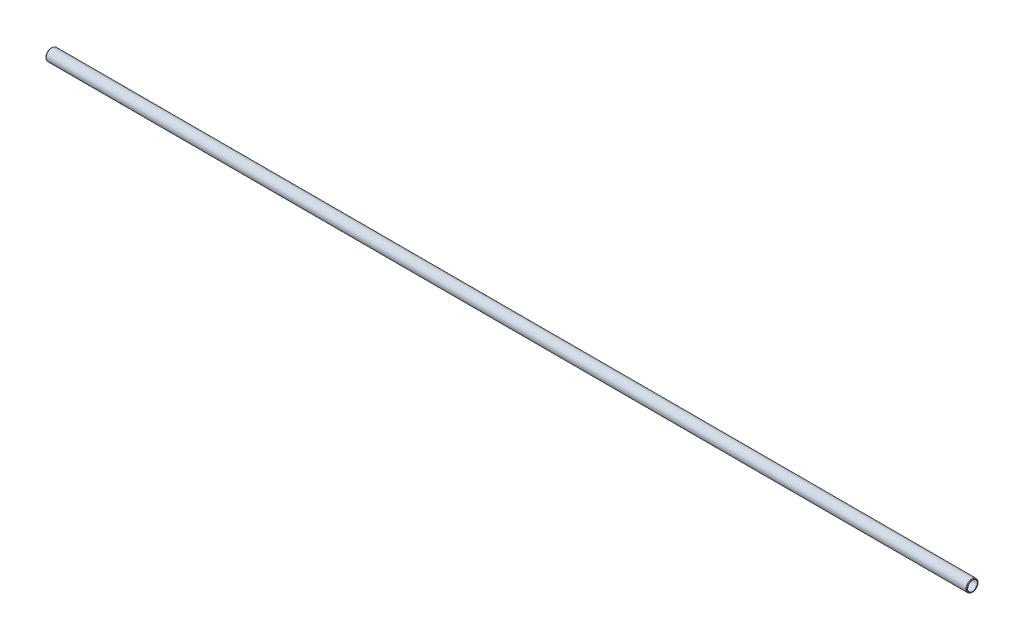
ISO-10303-21;
HEADER;
FILE_DESCRIPTION(('STEP AP214'),'2;1');
FILE_NAME('part.step','',(''),(''),'','','');
FILE_SCHEMA(('AUTOMOTIVE_DESIGN { 1 0 10303 214 1 1 1 1 }'));
ENDSEC;
DATA;
#1=APPLICATION_CONTEXT('core data for automotive mechanical design processes');
#2=APPLICATION_PROTOCOL_DEFINITION('international standard','automotive_design',2000,#1);
#3=PRODUCT_CONTEXT('',#1,'mechanical');
#4=PRODUCT('Part','Part','',(#3));
#5=PRODUCT_RELATED_PRODUCT_CATEGORY('part','',(#4));
#6=PRODUCT_DEFINITION_FORMATION('','',#4);
#7=PRODUCT_DEFINITION_CONTEXT('part definition',#1,'design');
#8=PRODUCT_DEFINITION('design','',#6,#7);
#9=PRODUCT_DEFINITION_SHAPE('','',#8);
#10=(LENGTH_UNIT() NAMED_UNIT(*) SI_UNIT(.MILLI.,.METRE.));
#11=(NAMED_UNIT(*) PLANE_ANGLE_UNIT() SI_UNIT($,.RADIAN.));
#12=(NAMED_UNIT(*) SI_UNIT($,.STERADIAN.) SOLID_ANGLE_UNIT());
#13=UNCERTAINTY_MEASURE_WITH_UNIT(LENGTH_MEASURE(1.E-05),#10,'distance_accuracy_value','');
#14=(GEOMETRIC_REPRESENTATION_CONTEXT(3) GLOBAL_UNCERTAINTY_ASSIGNED_CONTEXT((#13)) GLOBAL_UNIT_ASSIGNED_CONTEXT((#10,
#11,#12)) REPRESENTATION_CONTEXT('',''));
#15=CARTESIAN_POINT('',(0.,0.,0.));
#16=DIRECTION('',(0.,0.,1.));
#17=DIRECTION('',(1.,0.,0.));
#18=AXIS2_PLACEMENT_3D('',#15,#16,#17);
#19=CARTESIAN_POINT('',(-0.306605122421363,0.,0.));
#20=DIRECTION('',(-1.,0.,0.));
#21=DIRECTION('',(0.,0.,1.));
#22=AXIS2_PLACEMENT_3D('',#19,#20,#21);
#23=TOROIDAL_SURFACE('',#22,5.3947602448428,0.127000000000017);
#24=CARTESIAN_POINT('',(-0.396407683632027,0.,0.));
#25=DIRECTION('',(-1.,0.,0.));
#26=DIRECTION('',(0.,0.,1.));
#27=AXIS2_PLACEMENT_3D('',#24,#25,#26);
#28=CIRCLE('',#27,5.3049576836321);
#29=CARTESIAN_POINT('',(-0.396407683632027,0.,5.3049576836321));
#30=VERTEX_POINT('',#29);
#31=EDGE_CURVE('E10',#30,#30,#28,.T.);
#32=ORIENTED_EDGE('',*,*,#31,.F.);
#33=EDGE_LOOP('',(#32));
#34=FACE_BOUND('',#33,.T.);
#35=CARTESIAN_POINT('',(-0.396407683632027,0.,0.));
#36=DIRECTION('',(-1.,0.,0.));
#37=DIRECTION('',(0.,0.,1.));
#38=AXIS2_PLACEMENT_3D('',#35,#36,#37);
#39=CIRCLE('',#38,5.4845628060535);
#40=CARTESIAN_POINT('',(-0.396407683632027,0.,5.4845628060535));
#41=VERTEX_POINT('',#40);
#42=EDGE_CURVE('E78',#41,#41,#39,.T.);
#43=ORIENTED_EDGE('',*,*,#42,.T.);
#44=EDGE_LOOP('',(#43));
#45=FACE_BOUND('',#44,.T.);
#46=ADVANCED_FACE('F32',(#34,#45),#23,.T.);
#47=CARTESIAN_POINT('',(-0.396407683632027,0.,0.));
#48=DIRECTION('',(-1.,0.,0.));
#49=DIRECTION('',(0.,0.,1.));
#50=AXIS2_PLACEMENT_3D('',#47,#48,#49);
#51=CONICAL_SURFACE('',#50,5.3049576836321,0.785398163397622);
#52=CARTESIAN_POINT('',(-0.253999999999976,0.,0.));
#53=DIRECTION('',(-1.,0.,0.));
#54=DIRECTION('',(0.,0.,1.));
#55=AXIS2_PLACEMENT_3D('',#52,#53,#54);
#56=CIRCLE('',#55,5.16255);
#57=CARTESIAN_POINT('',(-0.253999999999976,0.,5.16255));
#58=VERTEX_POINT('',#57);
#59=EDGE_CURVE('E38',#58,#58,#56,.T.);
#60=ORIENTED_EDGE('',*,*,#59,.F.);
#61=EDGE_LOOP('',(#60));
#62=FACE_BOUND('',#61,.T.);
#63=ORIENTED_EDGE('',*,*,#31,.T.);
#64=EDGE_LOOP('',(#63));
#65=FACE_BOUND('',#64,.T.);
#66=ADVANCED_FACE('F151',(#62,#65),#51,.F.);
#67=CARTESIAN_POINT('',(959.358,0.,0.));
#68=DIRECTION('',(-1.,0.,0.));
#69=DIRECTION('',(0.,0.,1.));
#70=AXIS2_PLACEMENT_3D('',#67,#68,#69);
#71=CYLINDRICAL_SURFACE('',#70,5.16255);
#72=CARTESIAN_POINT('',(0.,0.,0.));
#73=DIRECTION('',(-1.,0.,0.));
#74=DIRECTION('',(0.,0.,1.));
#75=AXIS2_PLACEMENT_3D('',#72,#73,#74);
#76=CIRCLE('',#75,5.16255);
#77=CARTESIAN_POINT('',(0.,0.,5.16255));
#78=VERTEX_POINT('',#77);
#79=EDGE_CURVE('E42',#78,#78,#76,.T.);
#80=ORIENTED_EDGE('',*,*,#79,.F.);
#81=EDGE_LOOP('',(#80));
#82=FACE_BOUND('',#81,.T.);
#83=ORIENTED_EDGE('',*,*,#59,.T.);
#84=EDGE_LOOP('',(#83));
#85=FACE_BOUND('',#84,.T.);
#86=ADVANCED_FACE('F146',(#82,#85),#71,.F.);
#87=CARTESIAN_POINT('',(0.,0.,0.));
#88=DIRECTION('',(1.,0.,0.));
#89=DIRECTION('',(0.,0.,-1.));
#90=AXIS2_PLACEMENT_3D('',#87,#88,#89);
#91=CONICAL_SURFACE('',#90,5.16255,0.785398163397495);
#92=CARTESIAN_POINT('',(0.507999999999953,0.,0.));
#93=DIRECTION('',(-1.,0.,0.));
#94=DIRECTION('',(0.,0.,1.));
#95=AXIS2_PLACEMENT_3D('',#92,#93,#94);
#96=CIRCLE('',#95,5.67055);
#97=CARTESIAN_POINT('',(0.507999999999953,0.,5.67055));
#98=VERTEX_POINT('',#97);
#99=EDGE_CURVE('E46',#98,#98,#96,.T.);
#100=ORIENTED_EDGE('',*,*,#99,.F.);
#101=EDGE_LOOP('',(#100));
#102=FACE_BOUND('',#101,.T.);
#103=ORIENTED_EDGE('',*,*,#79,.T.);
#104=EDGE_LOOP('',(#103));
#105=FACE_BOUND('',#104,.T.);
#106=ADVANCED_FACE('F140',(#102,#105),#91,.F.);
#107=CARTESIAN_POINT('',(959.358,0.,0.));
#108=DIRECTION('',(-1.,0.,0.));
#109=DIRECTION('',(0.,0.,1.));
#110=AXIS2_PLACEMENT_3D('',#107,#108,#109);
#111=CYLINDRICAL_SURFACE('',#110,5.67055);
#112=CARTESIAN_POINT('',(958.85,0.,0.));
#113=DIRECTION('',(-1.,0.,0.));
#114=DIRECTION('',(0.,0.,1.));
#115=AXIS2_PLACEMENT_3D('',#112,#113,#114);
#116=CIRCLE('',#115,5.67055);
#117=CARTESIAN_POINT('',(958.85,0.,5.67055));
#118=VERTEX_POINT('',#117);
#119=EDGE_CURVE('E51',#118,#118,#116,.T.);
#120=ORIENTED_EDGE('',*,*,#119,.F.);
#121=EDGE_LOOP('',(#120));
#122=FACE_BOUND('',#121,.T.);
#123=ORIENTED_EDGE('',*,*,#99,.T.);
#124=EDGE_LOOP('',(#123));
#125=FACE_BOUND('',#124,.T.);
#126=ADVANCED_FACE('F134',(#122,#125),#111,.F.);
#127=CARTESIAN_POINT('',(958.85,0.,0.));
#128=DIRECTION('',(-1.,0.,0.));
#129=DIRECTION('',(0.,0.,1.));
#130=AXIS2_PLACEMENT_3D('',#127,#128,#129);
#131=CONICAL_SURFACE('',#130,5.67055,0.785398163397604);
#132=CARTESIAN_POINT('',(959.358,0.,0.));
#133=DIRECTION('',(-1.,0.,0.));
#134=DIRECTION('',(0.,0.,1.));
#135=AXIS2_PLACEMENT_3D('',#132,#133,#134);
#136=CIRCLE('',#135,5.16255);
#137=CARTESIAN_POINT('',(959.358,0.,5.16255));
#138=VERTEX_POINT('',#137);
#139=EDGE_CURVE('E54',#138,#138,#136,.T.);
#140=ORIENTED_EDGE('',*,*,#139,.F.);
#141=EDGE_LOOP('',(#140));
#142=FACE_BOUND('',#141,.T.);
#143=ORIENTED_EDGE('',*,*,#119,.T.);
#144=EDGE_LOOP('',(#143));
#145=FACE_BOUND('',#144,.T.);
#146=ADVANCED_FACE('F128',(#142,#145),#131,.F.);
#147=CARTESIAN_POINT('',(959.358,0.,0.));
#148=DIRECTION('',(-1.,0.,0.));
#149=DIRECTION('',(0.,0.,1.));
#150=AXIS2_PLACEMENT_3D('',#147,#148,#149);
#151=CYLINDRICAL_SURFACE('',#150,5.16255);
#152=CARTESIAN_POINT('',(959.612,0.,0.));
#153=DIRECTION('',(-1.,0.,0.));
#154=DIRECTION('',(0.,0.,1.));
#155=AXIS2_PLACEMENT_3D('',#152,#153,#154);
#156=CIRCLE('',#155,5.16255);
#157=CARTESIAN_POINT('',(959.612,0.,5.16255));
#158=VERTEX_POINT('',#157);
#159=EDGE_CURVE('E57',#158,#158,#156,.T.);
#160=ORIENTED_EDGE('',*,*,#159,.F.);
#161=EDGE_LOOP('',(#160));
#162=FACE_BOUND('',#161,.T.);
#163=ORIENTED_EDGE('',*,*,#139,.T.);
#164=EDGE_LOOP('',(#163));
#165=FACE_BOUND('',#164,.T.);
#166=ADVANCED_FACE('F122',(#162,#165),#151,.F.);
#167=CARTESIAN_POINT('',(959.612,0.,0.));
#168=DIRECTION('',(1.,0.,0.));
#169=DIRECTION('',(0.,0.,-1.));
#170=AXIS2_PLACEMENT_3D('',#167,#168,#169);
#171=CONICAL_SURFACE('',#170,5.16255,0.785398163404638);
#172=CARTESIAN_POINT('',(959.75440768363,0.,0.));
#173=DIRECTION('',(-1.,0.,0.));
#174=DIRECTION('',(0.,0.,1.));
#175=AXIS2_PLACEMENT_3D('',#172,#173,#174);
#176=CIRCLE('',#175,5.3049576836321);
#177=CARTESIAN_POINT('',(959.75440768363,0.,5.3049576836321));
#178=VERTEX_POINT('',#177);
#179=EDGE_CURVE('E60',#178,#178,#176,.T.);
#180=ORIENTED_EDGE('',*,*,#179,.F.);
#181=EDGE_LOOP('',(#180));
#182=FACE_BOUND('',#181,.T.);
#183=ORIENTED_EDGE('',*,*,#159,.T.);
#184=EDGE_LOOP('',(#183));
#185=FACE_BOUND('',#184,.T.);
#186=ADVANCED_FACE('F116',(#182,#185),#171,.F.);
#187=CARTESIAN_POINT('',(959.664605122421,0.,0.));
#188=DIRECTION('',(-1.,0.,0.));
#189=DIRECTION('',(0.,0.,1.));
#190=AXIS2_PLACEMENT_3D('',#187,#188,#189);
#191=TOROIDAL_SURFACE('',#190,5.3947602448428,0.126999999998532);
#192=CARTESIAN_POINT('',(959.75440768363,0.,0.));
#193=DIRECTION('',(-1.,0.,0.));
#194=DIRECTION('',(0.,0.,1.));
#195=AXIS2_PLACEMENT_3D('',#192,#193,#194);
#196=CIRCLE('',#195,5.4845628060535);
#197=CARTESIAN_POINT('',(959.75440768363,0.,5.4845628060535));
#198=VERTEX_POINT('',#197);
#199=EDGE_CURVE('E63',#198,#198,#196,.T.);
#200=ORIENTED_EDGE('',*,*,#199,.F.);
#201=EDGE_LOOP('',(#200));
#202=FACE_BOUND('',#201,.T.);
#203=ORIENTED_EDGE('',*,*,#179,.T.);
#204=EDGE_LOOP('',(#203));
#205=FACE_BOUND('',#204,.T.);
#206=ADVANCED_FACE('F110',(#202,#205),#191,.T.);
#207=CARTESIAN_POINT('',(959.75440768363,0.,0.));
#208=DIRECTION('',(-1.,0.,0.));
#209=DIRECTION('',(0.,0.,1.));
#210=AXIS2_PLACEMENT_3D('',#207,#208,#209);
#211=CONICAL_SURFACE('',#210,5.4845628060535,0.785398163396756);
#212=CARTESIAN_POINT('',(959.22191024484,0.,0.));
#213=DIRECTION('',(-1.,0.,0.));
#214=DIRECTION('',(0.,0.,1.));
#215=AXIS2_PLACEMENT_3D('',#212,#213,#214);
#216=CIRCLE('',#215,6.01706024484279);
#217=CARTESIAN_POINT('',(959.22191024484,0.,6.01706024484279));
#218=VERTEX_POINT('',#217);
#219=EDGE_CURVE('E66',#218,#218,#216,.T.);
#220=ORIENTED_EDGE('',*,*,#219,.F.);
#221=EDGE_LOOP('',(#220));
#222=FACE_BOUND('',#221,.T.);
#223=ORIENTED_EDGE('',*,*,#199,.T.);
#224=EDGE_LOOP('',(#223));
#225=FACE_BOUND('',#224,.T.);
#226=ADVANCED_FACE('F104',(#222,#225),#211,.T.);
#227=CARTESIAN_POINT('',(958.862699999999,0.,0.));
#228=DIRECTION('',(-1.,0.,0.));
#229=DIRECTION('',(0.,0.,1.));
#230=AXIS2_PLACEMENT_3D('',#227,#228,#229);
#231=TOROIDAL_SURFACE('',#230,5.65785000000511,0.507999999994898);
#232=CARTESIAN_POINT('',(958.8627,0.,0.));
#233=DIRECTION('',(-1.,0.,0.));
#234=DIRECTION('',(0.,0.,1.));
#235=AXIS2_PLACEMENT_3D('',#232,#233,#234);
#236=CIRCLE('',#235,6.16585);
#237=CARTESIAN_POINT('',(958.8627,0.,6.16585));
#238=VERTEX_POINT('',#237);
#239=EDGE_CURVE('E69',#238,#238,#236,.T.);
#240=ORIENTED_EDGE('',*,*,#239,.F.);
#241=EDGE_LOOP('',(#240));
#242=FACE_BOUND('',#241,.T.);
#243=ORIENTED_EDGE('',*,*,#219,.T.);
#244=EDGE_LOOP('',(#243));
#245=FACE_BOUND('',#244,.T.);
#246=ADVANCED_FACE('F98',(#242,#245),#231,.T.);
#247=CARTESIAN_POINT('',(959.358,0.,0.));
#248=DIRECTION('',(-1.,0.,0.));
#249=DIRECTION('',(0.,0.,1.));
#250=AXIS2_PLACEMENT_3D('',#247,#248,#249);
#251=CYLINDRICAL_SURFACE('',#250,6.16585);
#252=CARTESIAN_POINT('',(0.495299999999976,0.,0.));
#253=DIRECTION('',(-1.,0.,0.));
#254=DIRECTION('',(0.,0.,1.));
#255=AXIS2_PLACEMENT_3D('',#252,#253,#254);
#256=CIRCLE('',#255,6.16585);
#257=CARTESIAN_POINT('',(0.495299999999976,0.,6.16585));
#258=VERTEX_POINT('',#257);
#259=EDGE_CURVE('E72',#258,#258,#256,.T.);
#260=ORIENTED_EDGE('',*,*,#259,.F.);
#261=EDGE_LOOP('',(#260));
#262=FACE_BOUND('',#261,.T.);
#263=ORIENTED_EDGE('',*,*,#239,.T.);
#264=EDGE_LOOP('',(#263));
#265=FACE_BOUND('',#264,.T.);
#266=ADVANCED_FACE('F92',(#262,#265),#251,.T.);
#267=CARTESIAN_POINT('',(0.495300000000201,0.,0.));
#268=DIRECTION('',(-1.,0.,0.));
#269=DIRECTION('',(0.,0.,1.));
#270=AXIS2_PLACEMENT_3D('',#267,#268,#269);
#271=TOROIDAL_SURFACE('',#270,5.65784999999942,0.508000000000577);
#272=CARTESIAN_POINT('',(0.13608975515722,0.,0.));
#273=DIRECTION('',(-1.,0.,0.));
#274=DIRECTION('',(0.,0.,1.));
#275=AXIS2_PLACEMENT_3D('',#272,#273,#274);
#276=CIRCLE('',#275,6.0170602448428);
#277=CARTESIAN_POINT('',(0.13608975515722,0.,6.0170602448428));
#278=VERTEX_POINT('',#277);
#279=EDGE_CURVE('E75',#278,#278,#276,.T.);
#280=ORIENTED_EDGE('',*,*,#279,.F.);
#281=EDGE_LOOP('',(#280));
#282=FACE_BOUND('',#281,.T.);
#283=ORIENTED_EDGE('',*,*,#259,.T.);
#284=EDGE_LOOP('',(#283));
#285=FACE_BOUND('',#284,.T.);
#286=ADVANCED_FACE('F86',(#282,#285),#271,.T.);
#287=CARTESIAN_POINT('',(0.13608975515722,0.,0.));
#288=DIRECTION('',(1.,0.,0.));
#289=DIRECTION('',(0.,0.,-1.));
#290=AXIS2_PLACEMENT_3D('',#287,#288,#289);
#291=CONICAL_SURFACE('',#290,6.0170602448428,0.785398163397497);
#292=ORIENTED_EDGE('',*,*,#42,.F.);
#293=EDGE_LOOP('',(#292));
#294=FACE_BOUND('',#293,.T.);
#295=ORIENTED_EDGE('',*,*,#279,.T.);
#296=EDGE_LOOP('',(#295));
#297=FACE_BOUND('',#296,.T.);
#298=ADVANCED_FACE('F83',(#294,#297),#291,.T.);
#299=CLOSED_SHELL('',(#46,#66,#86,#106,#126,#146,#166,#186,#206,#226,#246,#266,#286,#298));
#300=MANIFOLD_SOLID_BREP('B2',#299);
#301=ADVANCED_BREP_SHAPE_REPRESENTATION('',(#18,#300),#14);
#302=SHAPE_DEFINITION_REPRESENTATION(#9,#301);
ENDSEC;
END-ISO-10303-21;
